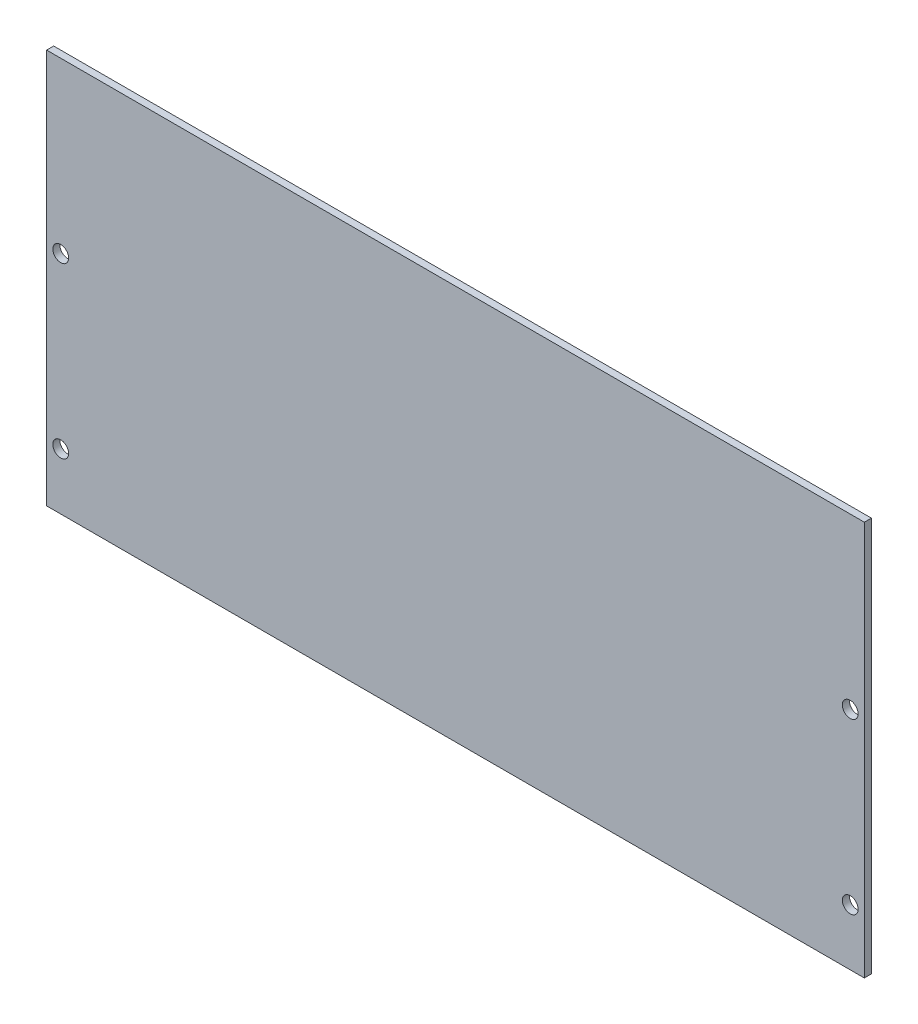
ISO-10303-21;
HEADER;
FILE_DESCRIPTION(('STEP AP214'),'2;1');
FILE_NAME('part.step','',(''),(''),'','','');
FILE_SCHEMA(('AUTOMOTIVE_DESIGN { 1 0 10303 214 1 1 1 1 }'));
ENDSEC;
DATA;
#1=APPLICATION_CONTEXT('core data for automotive mechanical design processes');
#2=APPLICATION_PROTOCOL_DEFINITION('international standard','automotive_design',2000,#1);
#3=PRODUCT_CONTEXT('',#1,'mechanical');
#4=PRODUCT('Part','Part','',(#3));
#5=PRODUCT_RELATED_PRODUCT_CATEGORY('part','',(#4));
#6=PRODUCT_DEFINITION_FORMATION('','',#4);
#7=PRODUCT_DEFINITION_CONTEXT('part definition',#1,'design');
#8=PRODUCT_DEFINITION('design','',#6,#7);
#9=PRODUCT_DEFINITION_SHAPE('','',#8);
#10=(LENGTH_UNIT() NAMED_UNIT(*) SI_UNIT(.MILLI.,.METRE.));
#11=(NAMED_UNIT(*) PLANE_ANGLE_UNIT() SI_UNIT($,.RADIAN.));
#12=(NAMED_UNIT(*) SI_UNIT($,.STERADIAN.) SOLID_ANGLE_UNIT());
#13=UNCERTAINTY_MEASURE_WITH_UNIT(LENGTH_MEASURE(1.E-05),#10,'distance_accuracy_value','');
#14=(GEOMETRIC_REPRESENTATION_CONTEXT(3) GLOBAL_UNCERTAINTY_ASSIGNED_CONTEXT((#13)) GLOBAL_UNIT_ASSIGNED_CONTEXT((#10,
#11,#12)) REPRESENTATION_CONTEXT('',''));
#15=CARTESIAN_POINT('',(0.,0.,0.));
#16=DIRECTION('',(0.,0.,1.));
#17=DIRECTION('',(1.,0.,0.));
#18=AXIS2_PLACEMENT_3D('',#15,#16,#17);
#19=CARTESIAN_POINT('',(0.,0.,3.175));
#20=DIRECTION('',(0.,0.,1.));
#21=DIRECTION('',(1.,0.,0.));
#22=AXIS2_PLACEMENT_3D('',#19,#20,#21);
#23=PLANE('',#22);
#24=CARTESIAN_POINT('',(177.8,101.6,3.175));
#25=DIRECTION('',(0.,0.,1.));
#26=DIRECTION('',(-1.,0.,0.));
#27=AXIS2_PLACEMENT_3D('',#24,#25,#26);
#28=CIRCLE('',#27,3.55600000000001);
#29=CARTESIAN_POINT('',(174.244,101.6,3.175));
#30=VERTEX_POINT('',#29);
#31=EDGE_CURVE('E148',#30,#30,#28,.T.);
#32=ORIENTED_EDGE('',*,*,#31,.F.);
#33=EDGE_LOOP('',(#32));
#34=FACE_BOUND('',#33,.T.);
#35=CARTESIAN_POINT('',(-177.8,25.4,3.175));
#36=DIRECTION('',(0.,0.,1.));
#37=DIRECTION('',(1.,0.,0.));
#38=AXIS2_PLACEMENT_3D('',#35,#36,#37);
#39=CIRCLE('',#38,3.55599999999998);
#40=CARTESIAN_POINT('',(-174.244,25.4,3.175));
#41=VERTEX_POINT('',#40);
#42=EDGE_CURVE('E118',#41,#41,#39,.T.);
#43=ORIENTED_EDGE('',*,*,#42,.F.);
#44=EDGE_LOOP('',(#43));
#45=FACE_BOUND('',#44,.T.);
#46=DIRECTION('',(0.,-1.,0.));
#47=VECTOR('',#46,1.);
#48=CARTESIAN_POINT('',(-184.15,177.8,3.175));
#49=LINE('',#48,#47);
#50=CARTESIAN_POINT('',(-184.15,177.8,3.175));
#51=VERTEX_POINT('',#50);
#52=CARTESIAN_POINT('',(-184.15,0.,3.175));
#53=VERTEX_POINT('',#52);
#54=EDGE_CURVE('E98',#51,#53,#49,.T.);
#55=ORIENTED_EDGE('',*,*,#54,.T.);
#56=DIRECTION('',(1.,0.,0.));
#57=VECTOR('',#56,1.);
#58=CARTESIAN_POINT('',(-184.15,0.,3.175));
#59=LINE('',#58,#57);
#60=CARTESIAN_POINT('',(184.15,0.,3.175));
#61=VERTEX_POINT('',#60);
#62=EDGE_CURVE('E93',#53,#61,#59,.T.);
#63=ORIENTED_EDGE('',*,*,#62,.T.);
#64=DIRECTION('',(0.,1.,0.));
#65=VECTOR('',#64,1.);
#66=CARTESIAN_POINT('',(184.15,177.8,3.175));
#67=LINE('',#66,#65);
#68=CARTESIAN_POINT('',(184.15,177.8,3.175));
#69=VERTEX_POINT('',#68);
#70=EDGE_CURVE('E96',#61,#69,#67,.T.);
#71=ORIENTED_EDGE('',*,*,#70,.T.);
#72=DIRECTION('',(-1.,0.,0.));
#73=VECTOR('',#72,1.);
#74=CARTESIAN_POINT('',(-184.15,177.8,3.175));
#75=LINE('',#74,#73);
#76=EDGE_CURVE('E63',#69,#51,#75,.T.);
#77=ORIENTED_EDGE('',*,*,#76,.T.);
#78=EDGE_LOOP('',(#55,#63,#71,#77));
#79=FACE_BOUND('',#78,.T.);
#80=CARTESIAN_POINT('',(-177.8,101.6,3.175));
#81=DIRECTION('',(0.,0.,1.));
#82=DIRECTION('',(1.,0.,0.));
#83=AXIS2_PLACEMENT_3D('',#80,#81,#82);
#84=CIRCLE('',#83,3.55600000000001);
#85=CARTESIAN_POINT('',(-174.244,101.6,3.175));
#86=VERTEX_POINT('',#85);
#87=EDGE_CURVE('E140',#86,#86,#84,.T.);
#88=ORIENTED_EDGE('',*,*,#87,.F.);
#89=EDGE_LOOP('',(#88));
#90=FACE_BOUND('',#89,.T.);
#91=CARTESIAN_POINT('',(177.8,25.4,3.175));
#92=DIRECTION('',(0.,0.,1.));
#93=DIRECTION('',(-1.,0.,0.));
#94=AXIS2_PLACEMENT_3D('',#91,#92,#93);
#95=CIRCLE('',#94,3.55599999999998);
#96=CARTESIAN_POINT('',(174.244,25.4,3.175));
#97=VERTEX_POINT('',#96);
#98=EDGE_CURVE('E156',#97,#97,#95,.T.);
#99=ORIENTED_EDGE('',*,*,#98,.F.);
#100=EDGE_LOOP('',(#99));
#101=FACE_BOUND('',#100,.T.);
#102=ADVANCED_FACE('F45',(#34,#45,#79,#90,#101),#23,.T.);
#103=CARTESIAN_POINT('',(0.,0.,0.));
#104=DIRECTION('',(0.,0.,1.));
#105=DIRECTION('',(1.,0.,0.));
#106=AXIS2_PLACEMENT_3D('',#103,#104,#105);
#107=PLANE('',#106);
#108=DIRECTION('',(0.,-1.,0.));
#109=VECTOR('',#108,1.);
#110=CARTESIAN_POINT('',(-184.15,177.8,0.));
#111=LINE('',#110,#109);
#112=CARTESIAN_POINT('',(-184.15,177.8,0.));
#113=VERTEX_POINT('',#112);
#114=CARTESIAN_POINT('',(-184.15,0.,0.));
#115=VERTEX_POINT('',#114);
#116=EDGE_CURVE('E114',#113,#115,#111,.T.);
#117=ORIENTED_EDGE('',*,*,#116,.F.);
#118=DIRECTION('',(-1.,0.,0.));
#119=VECTOR('',#118,1.);
#120=CARTESIAN_POINT('',(-184.15,177.8,0.));
#121=LINE('',#120,#119);
#122=CARTESIAN_POINT('',(184.15,177.8,0.));
#123=VERTEX_POINT('',#122);
#124=EDGE_CURVE('E86',#123,#113,#121,.T.);
#125=ORIENTED_EDGE('',*,*,#124,.F.);
#126=DIRECTION('',(0.,1.,0.));
#127=VECTOR('',#126,1.);
#128=CARTESIAN_POINT('',(184.15,177.8,0.));
#129=LINE('',#128,#127);
#130=CARTESIAN_POINT('',(184.15,0.,0.));
#131=VERTEX_POINT('',#130);
#132=EDGE_CURVE('E80',#131,#123,#129,.T.);
#133=ORIENTED_EDGE('',*,*,#132,.F.);
#134=DIRECTION('',(1.,0.,0.));
#135=VECTOR('',#134,1.);
#136=CARTESIAN_POINT('',(-184.15,0.,0.));
#137=LINE('',#136,#135);
#138=EDGE_CURVE('E103',#115,#131,#137,.T.);
#139=ORIENTED_EDGE('',*,*,#138,.F.);
#140=EDGE_LOOP('',(#117,#125,#133,#139));
#141=FACE_BOUND('',#140,.T.);
#142=CARTESIAN_POINT('',(-177.8,25.4,0.));
#143=DIRECTION('',(0.,0.,1.));
#144=DIRECTION('',(1.,0.,0.));
#145=AXIS2_PLACEMENT_3D('',#142,#143,#144);
#146=CIRCLE('',#145,3.55599999999998);
#147=CARTESIAN_POINT('',(-174.244,25.4,0.));
#148=VERTEX_POINT('',#147);
#149=EDGE_CURVE('E136',#148,#148,#146,.T.);
#150=ORIENTED_EDGE('',*,*,#149,.T.);
#151=EDGE_LOOP('',(#150));
#152=FACE_BOUND('',#151,.T.);
#153=CARTESIAN_POINT('',(-177.8,101.6,0.));
#154=DIRECTION('',(0.,0.,1.));
#155=DIRECTION('',(1.,0.,0.));
#156=AXIS2_PLACEMENT_3D('',#153,#154,#155);
#157=CIRCLE('',#156,3.55600000000001);
#158=CARTESIAN_POINT('',(-174.244,101.6,0.));
#159=VERTEX_POINT('',#158);
#160=EDGE_CURVE('E144',#159,#159,#157,.T.);
#161=ORIENTED_EDGE('',*,*,#160,.T.);
#162=EDGE_LOOP('',(#161));
#163=FACE_BOUND('',#162,.T.);
#164=CARTESIAN_POINT('',(177.8,101.6,0.));
#165=DIRECTION('',(0.,0.,1.));
#166=DIRECTION('',(-1.,0.,0.));
#167=AXIS2_PLACEMENT_3D('',#164,#165,#166);
#168=CIRCLE('',#167,3.55600000000001);
#169=CARTESIAN_POINT('',(174.244,101.6,0.));
#170=VERTEX_POINT('',#169);
#171=EDGE_CURVE('E152',#170,#170,#168,.T.);
#172=ORIENTED_EDGE('',*,*,#171,.T.);
#173=EDGE_LOOP('',(#172));
#174=FACE_BOUND('',#173,.T.);
#175=CARTESIAN_POINT('',(177.8,25.4,0.));
#176=DIRECTION('',(0.,0.,1.));
#177=DIRECTION('',(-1.,0.,0.));
#178=AXIS2_PLACEMENT_3D('',#175,#176,#177);
#179=CIRCLE('',#178,3.55599999999998);
#180=CARTESIAN_POINT('',(174.244,25.4,0.));
#181=VERTEX_POINT('',#180);
#182=EDGE_CURVE('E160',#181,#181,#179,.T.);
#183=ORIENTED_EDGE('',*,*,#182,.T.);
#184=EDGE_LOOP('',(#183));
#185=FACE_BOUND('',#184,.T.);
#186=ADVANCED_FACE('F131',(#141,#152,#163,#174,#185),#107,.F.);
#187=CARTESIAN_POINT('',(-184.15,177.8,3.175));
#188=DIRECTION('',(1.,0.,0.));
#189=DIRECTION('',(0.,0.,-1.));
#190=AXIS2_PLACEMENT_3D('',#187,#188,#189);
#191=PLANE('',#190);
#192=ORIENTED_EDGE('',*,*,#116,.T.);
#193=DIRECTION('',(0.,0.,-1.));
#194=VECTOR('',#193,1.);
#195=CARTESIAN_POINT('',(-184.15,0.,3.175));
#196=LINE('',#195,#194);
#197=EDGE_CURVE('E11',#53,#115,#196,.T.);
#198=ORIENTED_EDGE('',*,*,#197,.F.);
#199=ORIENTED_EDGE('',*,*,#54,.F.);
#200=DIRECTION('',(0.,0.,-1.));
#201=VECTOR('',#200,1.);
#202=CARTESIAN_POINT('',(-184.15,177.8,3.175));
#203=LINE('',#202,#201);
#204=EDGE_CURVE('E110',#51,#113,#203,.T.);
#205=ORIENTED_EDGE('',*,*,#204,.T.);
#206=EDGE_LOOP('',(#192,#198,#199,#205));
#207=FACE_BOUND('',#206,.T.);
#208=ADVANCED_FACE('F47',(#207),#191,.F.);
#209=CARTESIAN_POINT('',(-184.15,0.,3.175));
#210=DIRECTION('',(0.,1.,0.));
#211=DIRECTION('',(-1.,0.,0.));
#212=AXIS2_PLACEMENT_3D('',#209,#210,#211);
#213=PLANE('',#212);
#214=ORIENTED_EDGE('',*,*,#138,.T.);
#215=DIRECTION('',(0.,0.,-1.));
#216=VECTOR('',#215,1.);
#217=CARTESIAN_POINT('',(184.15,0.,3.175));
#218=LINE('',#217,#216);
#219=EDGE_CURVE('E55',#61,#131,#218,.T.);
#220=ORIENTED_EDGE('',*,*,#219,.F.);
#221=ORIENTED_EDGE('',*,*,#62,.F.);
#222=ORIENTED_EDGE('',*,*,#197,.T.);
#223=EDGE_LOOP('',(#214,#220,#221,#222));
#224=FACE_BOUND('',#223,.T.);
#225=ADVANCED_FACE('F102',(#224),#213,.F.);
#226=CARTESIAN_POINT('',(184.15,177.8,3.175));
#227=DIRECTION('',(-1.,0.,0.));
#228=DIRECTION('',(0.,0.,1.));
#229=AXIS2_PLACEMENT_3D('',#226,#227,#228);
#230=PLANE('',#229);
#231=ORIENTED_EDGE('',*,*,#132,.T.);
#232=DIRECTION('',(0.,0.,-1.));
#233=VECTOR('',#232,1.);
#234=CARTESIAN_POINT('',(184.15,177.8,3.175));
#235=LINE('',#234,#233);
#236=EDGE_CURVE('E105',#69,#123,#235,.T.);
#237=ORIENTED_EDGE('',*,*,#236,.F.);
#238=ORIENTED_EDGE('',*,*,#70,.F.);
#239=ORIENTED_EDGE('',*,*,#219,.T.);
#240=EDGE_LOOP('',(#231,#237,#238,#239));
#241=FACE_BOUND('',#240,.T.);
#242=ADVANCED_FACE('F106',(#241),#230,.F.);
#243=CARTESIAN_POINT('',(-184.15,177.8,3.175));
#244=DIRECTION('',(0.,-1.,0.));
#245=DIRECTION('',(1.,0.,0.));
#246=AXIS2_PLACEMENT_3D('',#243,#244,#245);
#247=PLANE('',#246);
#248=ORIENTED_EDGE('',*,*,#124,.T.);
#249=ORIENTED_EDGE('',*,*,#204,.F.);
#250=ORIENTED_EDGE('',*,*,#76,.F.);
#251=ORIENTED_EDGE('',*,*,#236,.T.);
#252=EDGE_LOOP('',(#248,#249,#250,#251));
#253=FACE_BOUND('',#252,.T.);
#254=ADVANCED_FACE('F128',(#253),#247,.F.);
#255=CARTESIAN_POINT('',(-177.8,25.4,3.175));
#256=DIRECTION('',(0.,0.,-1.));
#257=DIRECTION('',(-1.,0.,0.));
#258=AXIS2_PLACEMENT_3D('',#255,#256,#257);
#259=CYLINDRICAL_SURFACE('',#258,3.55599999999998);
#260=ORIENTED_EDGE('',*,*,#42,.T.);
#261=EDGE_LOOP('',(#260));
#262=FACE_BOUND('',#261,.T.);
#263=ORIENTED_EDGE('',*,*,#149,.F.);
#264=EDGE_LOOP('',(#263));
#265=FACE_BOUND('',#264,.T.);
#266=ADVANCED_FACE('F181',(#262,#265),#259,.F.);
#267=CARTESIAN_POINT('',(-177.8,101.6,3.175));
#268=DIRECTION('',(0.,0.,-1.));
#269=DIRECTION('',(-1.,0.,0.));
#270=AXIS2_PLACEMENT_3D('',#267,#268,#269);
#271=CYLINDRICAL_SURFACE('',#270,3.55600000000001);
#272=ORIENTED_EDGE('',*,*,#87,.T.);
#273=EDGE_LOOP('',(#272));
#274=FACE_BOUND('',#273,.T.);
#275=ORIENTED_EDGE('',*,*,#160,.F.);
#276=EDGE_LOOP('',(#275));
#277=FACE_BOUND('',#276,.T.);
#278=ADVANCED_FACE('F235',(#274,#277),#271,.F.);
#279=CARTESIAN_POINT('',(177.8,101.6,3.175));
#280=DIRECTION('',(0.,0.,-1.));
#281=DIRECTION('',(-1.,0.,0.));
#282=AXIS2_PLACEMENT_3D('',#279,#280,#281);
#283=CYLINDRICAL_SURFACE('',#282,3.55600000000001);
#284=ORIENTED_EDGE('',*,*,#31,.T.);
#285=EDGE_LOOP('',(#284));
#286=FACE_BOUND('',#285,.T.);
#287=ORIENTED_EDGE('',*,*,#171,.F.);
#288=EDGE_LOOP('',(#287));
#289=FACE_BOUND('',#288,.T.);
#290=ADVANCED_FACE('F244',(#286,#289),#283,.F.);
#291=CARTESIAN_POINT('',(177.8,25.4,3.175));
#292=DIRECTION('',(0.,0.,-1.));
#293=DIRECTION('',(-1.,0.,0.));
#294=AXIS2_PLACEMENT_3D('',#291,#292,#293);
#295=CYLINDRICAL_SURFACE('',#294,3.55599999999998);
#296=ORIENTED_EDGE('',*,*,#98,.T.);
#297=EDGE_LOOP('',(#296));
#298=FACE_BOUND('',#297,.T.);
#299=ORIENTED_EDGE('',*,*,#182,.F.);
#300=EDGE_LOOP('',(#299));
#301=FACE_BOUND('',#300,.T.);
#302=ADVANCED_FACE('F168',(#298,#301),#295,.F.);
#303=CLOSED_SHELL('',(#102,#186,#208,#225,#242,#254,#266,#278,#290,#302));
#304=MANIFOLD_SOLID_BREP('B2',#303);
#305=ADVANCED_BREP_SHAPE_REPRESENTATION('',(#18,#304),#14);
#306=SHAPE_DEFINITION_REPRESENTATION(#9,#305);
ENDSEC;
END-ISO-10303-21;
